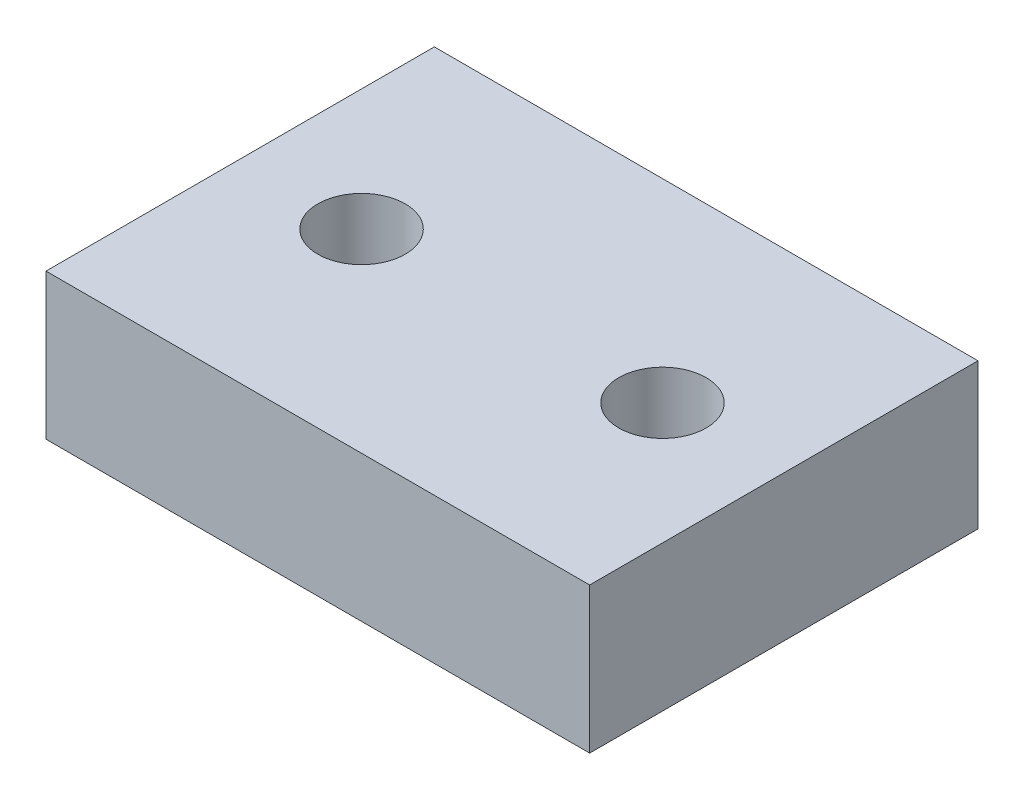
ISO-10303-21;
HEADER;
FILE_DESCRIPTION(('STEP AP214'),'2;1');
FILE_NAME('part.step','',(''),(''),'','','');
FILE_SCHEMA(('AUTOMOTIVE_DESIGN { 1 0 10303 214 1 1 1 1 }'));
ENDSEC;
DATA;
#1=APPLICATION_CONTEXT('core data for automotive mechanical design processes');
#2=APPLICATION_PROTOCOL_DEFINITION('international standard','automotive_design',2000,#1);
#3=PRODUCT_CONTEXT('',#1,'mechanical');
#4=PRODUCT('Part','Part','',(#3));
#5=PRODUCT_RELATED_PRODUCT_CATEGORY('part','',(#4));
#6=PRODUCT_DEFINITION_FORMATION('','',#4);
#7=PRODUCT_DEFINITION_CONTEXT('part definition',#1,'design');
#8=PRODUCT_DEFINITION('design','',#6,#7);
#9=PRODUCT_DEFINITION_SHAPE('','',#8);
#10=(LENGTH_UNIT() NAMED_UNIT(*) SI_UNIT(.MILLI.,.METRE.));
#11=(NAMED_UNIT(*) PLANE_ANGLE_UNIT() SI_UNIT($,.RADIAN.));
#12=(NAMED_UNIT(*) SI_UNIT($,.STERADIAN.) SOLID_ANGLE_UNIT());
#13=UNCERTAINTY_MEASURE_WITH_UNIT(LENGTH_MEASURE(1.E-05),#10,'distance_accuracy_value','');
#14=(GEOMETRIC_REPRESENTATION_CONTEXT(3) GLOBAL_UNCERTAINTY_ASSIGNED_CONTEXT((#13)) GLOBAL_UNIT_ASSIGNED_CONTEXT((#10,
#11,#12)) REPRESENTATION_CONTEXT('',''));
#15=CARTESIAN_POINT('',(0.,0.,0.));
#16=DIRECTION('',(0.,0.,1.));
#17=DIRECTION('',(1.,0.,0.));
#18=AXIS2_PLACEMENT_3D('',#15,#16,#17);
#19=CARTESIAN_POINT('',(0.,3.75,0.));
#20=DIRECTION('',(0.,1.,0.));
#21=DIRECTION('',(0.,0.,1.));
#22=AXIS2_PLACEMENT_3D('',#19,#20,#21);
#23=PLANE('',#22);
#24=CARTESIAN_POINT('',(-7.75,3.75,0.));
#25=DIRECTION('',(0.,1.,0.));
#26=DIRECTION('',(0.,0.,1.));
#27=AXIS2_PLACEMENT_3D('',#24,#25,#26);
#28=CIRCLE('',#27,2.25);
#29=CARTESIAN_POINT('',(-7.75,3.75,2.25));
#30=VERTEX_POINT('',#29);
#31=EDGE_CURVE('E118',#30,#30,#28,.T.);
#32=ORIENTED_EDGE('',*,*,#31,.F.);
#33=EDGE_LOOP('',(#32));
#34=FACE_BOUND('',#33,.T.);
#35=DIRECTION('',(0.,0.,1.));
#36=VECTOR('',#35,1.);
#37=CARTESIAN_POINT('',(-14.,3.75,10.));
#38=LINE('',#37,#36);
#39=CARTESIAN_POINT('',(-14.,3.75,-10.));
#40=VERTEX_POINT('',#39);
#41=CARTESIAN_POINT('',(-14.,3.75,10.));
#42=VERTEX_POINT('',#41);
#43=EDGE_CURVE('E98',#40,#42,#38,.T.);
#44=ORIENTED_EDGE('',*,*,#43,.T.);
#45=DIRECTION('',(1.,0.,0.));
#46=VECTOR('',#45,1.);
#47=CARTESIAN_POINT('',(14.,3.75,10.));
#48=LINE('',#47,#46);
#49=CARTESIAN_POINT('',(14.,3.75,10.));
#50=VERTEX_POINT('',#49);
#51=EDGE_CURVE('E93',#42,#50,#48,.T.);
#52=ORIENTED_EDGE('',*,*,#51,.T.);
#53=DIRECTION('',(0.,0.,-1.));
#54=VECTOR('',#53,1.);
#55=CARTESIAN_POINT('',(14.,3.75,10.));
#56=LINE('',#55,#54);
#57=CARTESIAN_POINT('',(14.,3.75,-10.));
#58=VERTEX_POINT('',#57);
#59=EDGE_CURVE('E96',#50,#58,#56,.T.);
#60=ORIENTED_EDGE('',*,*,#59,.T.);
#61=DIRECTION('',(-1.,0.,0.));
#62=VECTOR('',#61,1.);
#63=CARTESIAN_POINT('',(14.,3.75,-10.));
#64=LINE('',#63,#62);
#65=EDGE_CURVE('E63',#58,#40,#64,.T.);
#66=ORIENTED_EDGE('',*,*,#65,.T.);
#67=EDGE_LOOP('',(#44,#52,#60,#66));
#68=FACE_BOUND('',#67,.T.);
#69=CARTESIAN_POINT('',(7.75,3.75,0.));
#70=DIRECTION('',(0.,1.,0.));
#71=DIRECTION('',(0.,0.,1.));
#72=AXIS2_PLACEMENT_3D('',#69,#70,#71);
#73=CIRCLE('',#72,2.25);
#74=CARTESIAN_POINT('',(7.75,3.75,2.25));
#75=VERTEX_POINT('',#74);
#76=EDGE_CURVE('E140',#75,#75,#73,.T.);
#77=ORIENTED_EDGE('',*,*,#76,.F.);
#78=EDGE_LOOP('',(#77));
#79=FACE_BOUND('',#78,.T.);
#80=ADVANCED_FACE('F45',(#34,#68,#79),#23,.T.);
#81=CARTESIAN_POINT('',(0.,-3.75,0.));
#82=DIRECTION('',(0.,1.,0.));
#83=DIRECTION('',(0.,0.,1.));
#84=AXIS2_PLACEMENT_3D('',#81,#82,#83);
#85=PLANE('',#84);
#86=DIRECTION('',(0.,0.,1.));
#87=VECTOR('',#86,1.);
#88=CARTESIAN_POINT('',(-14.,-3.75,10.));
#89=LINE('',#88,#87);
#90=CARTESIAN_POINT('',(-14.,-3.75,-10.));
#91=VERTEX_POINT('',#90);
#92=CARTESIAN_POINT('',(-14.,-3.75,10.));
#93=VERTEX_POINT('',#92);
#94=EDGE_CURVE('E114',#91,#93,#89,.T.);
#95=ORIENTED_EDGE('',*,*,#94,.F.);
#96=DIRECTION('',(-1.,0.,0.));
#97=VECTOR('',#96,1.);
#98=CARTESIAN_POINT('',(14.,-3.75,-10.));
#99=LINE('',#98,#97);
#100=CARTESIAN_POINT('',(14.,-3.75,-10.));
#101=VERTEX_POINT('',#100);
#102=EDGE_CURVE('E86',#101,#91,#99,.T.);
#103=ORIENTED_EDGE('',*,*,#102,.F.);
#104=DIRECTION('',(0.,0.,-1.));
#105=VECTOR('',#104,1.);
#106=CARTESIAN_POINT('',(14.,-3.75,10.));
#107=LINE('',#106,#105);
#108=CARTESIAN_POINT('',(14.,-3.75,10.));
#109=VERTEX_POINT('',#108);
#110=EDGE_CURVE('E80',#109,#101,#107,.T.);
#111=ORIENTED_EDGE('',*,*,#110,.F.);
#112=DIRECTION('',(1.,0.,0.));
#113=VECTOR('',#112,1.);
#114=CARTESIAN_POINT('',(14.,-3.75,10.));
#115=LINE('',#114,#113);
#116=EDGE_CURVE('E103',#93,#109,#115,.T.);
#117=ORIENTED_EDGE('',*,*,#116,.F.);
#118=EDGE_LOOP('',(#95,#103,#111,#117));
#119=FACE_BOUND('',#118,.T.);
#120=CARTESIAN_POINT('',(-7.75,-3.75,0.));
#121=DIRECTION('',(0.,1.,0.));
#122=DIRECTION('',(0.,0.,1.));
#123=AXIS2_PLACEMENT_3D('',#120,#121,#122);
#124=CIRCLE('',#123,2.25);
#125=CARTESIAN_POINT('',(-7.75,-3.75,2.25));
#126=VERTEX_POINT('',#125);
#127=EDGE_CURVE('E136',#126,#126,#124,.T.);
#128=ORIENTED_EDGE('',*,*,#127,.T.);
#129=EDGE_LOOP('',(#128));
#130=FACE_BOUND('',#129,.T.);
#131=CARTESIAN_POINT('',(7.75,-3.75,0.));
#132=DIRECTION('',(0.,1.,0.));
#133=DIRECTION('',(0.,0.,1.));
#134=AXIS2_PLACEMENT_3D('',#131,#132,#133);
#135=CIRCLE('',#134,2.25);
#136=CARTESIAN_POINT('',(7.75,-3.75,2.25));
#137=VERTEX_POINT('',#136);
#138=EDGE_CURVE('E144',#137,#137,#135,.T.);
#139=ORIENTED_EDGE('',*,*,#138,.T.);
#140=EDGE_LOOP('',(#139));
#141=FACE_BOUND('',#140,.T.);
#142=ADVANCED_FACE('F131',(#119,#130,#141),#85,.F.);
#143=CARTESIAN_POINT('',(-14.,3.75,10.));
#144=DIRECTION('',(1.,0.,0.));
#145=DIRECTION('',(0.,0.,-1.));
#146=AXIS2_PLACEMENT_3D('',#143,#144,#145);
#147=PLANE('',#146);
#148=ORIENTED_EDGE('',*,*,#94,.T.);
#149=DIRECTION('',(0.,-1.,0.));
#150=VECTOR('',#149,1.);
#151=CARTESIAN_POINT('',(-14.,3.75,10.));
#152=LINE('',#151,#150);
#153=EDGE_CURVE('E11',#42,#93,#152,.T.);
#154=ORIENTED_EDGE('',*,*,#153,.F.);
#155=ORIENTED_EDGE('',*,*,#43,.F.);
#156=DIRECTION('',(0.,-1.,0.));
#157=VECTOR('',#156,1.);
#158=CARTESIAN_POINT('',(-14.,3.75,-10.));
#159=LINE('',#158,#157);
#160=EDGE_CURVE('E110',#40,#91,#159,.T.);
#161=ORIENTED_EDGE('',*,*,#160,.T.);
#162=EDGE_LOOP('',(#148,#154,#155,#161));
#163=FACE_BOUND('',#162,.T.);
#164=ADVANCED_FACE('F47',(#163),#147,.F.);
#165=CARTESIAN_POINT('',(14.,3.75,10.));
#166=DIRECTION('',(0.,0.,-1.));
#167=DIRECTION('',(-1.,0.,0.));
#168=AXIS2_PLACEMENT_3D('',#165,#166,#167);
#169=PLANE('',#168);
#170=ORIENTED_EDGE('',*,*,#116,.T.);
#171=DIRECTION('',(0.,-1.,0.));
#172=VECTOR('',#171,1.);
#173=CARTESIAN_POINT('',(14.,3.75,10.));
#174=LINE('',#173,#172);
#175=EDGE_CURVE('E55',#50,#109,#174,.T.);
#176=ORIENTED_EDGE('',*,*,#175,.F.);
#177=ORIENTED_EDGE('',*,*,#51,.F.);
#178=ORIENTED_EDGE('',*,*,#153,.T.);
#179=EDGE_LOOP('',(#170,#176,#177,#178));
#180=FACE_BOUND('',#179,.T.);
#181=ADVANCED_FACE('F102',(#180),#169,.F.);
#182=CARTESIAN_POINT('',(14.,3.75,10.));
#183=DIRECTION('',(-1.,0.,0.));
#184=DIRECTION('',(0.,0.,1.));
#185=AXIS2_PLACEMENT_3D('',#182,#183,#184);
#186=PLANE('',#185);
#187=ORIENTED_EDGE('',*,*,#110,.T.);
#188=DIRECTION('',(0.,-1.,0.));
#189=VECTOR('',#188,1.);
#190=CARTESIAN_POINT('',(14.,3.75,-10.));
#191=LINE('',#190,#189);
#192=EDGE_CURVE('E105',#58,#101,#191,.T.);
#193=ORIENTED_EDGE('',*,*,#192,.F.);
#194=ORIENTED_EDGE('',*,*,#59,.F.);
#195=ORIENTED_EDGE('',*,*,#175,.T.);
#196=EDGE_LOOP('',(#187,#193,#194,#195));
#197=FACE_BOUND('',#196,.T.);
#198=ADVANCED_FACE('F106',(#197),#186,.F.);
#199=CARTESIAN_POINT('',(14.,3.75,-10.));
#200=DIRECTION('',(0.,0.,1.));
#201=DIRECTION('',(1.,0.,0.));
#202=AXIS2_PLACEMENT_3D('',#199,#200,#201);
#203=PLANE('',#202);
#204=ORIENTED_EDGE('',*,*,#102,.T.);
#205=ORIENTED_EDGE('',*,*,#160,.F.);
#206=ORIENTED_EDGE('',*,*,#65,.F.);
#207=ORIENTED_EDGE('',*,*,#192,.T.);
#208=EDGE_LOOP('',(#204,#205,#206,#207));
#209=FACE_BOUND('',#208,.T.);
#210=ADVANCED_FACE('F128',(#209),#203,.F.);
#211=CARTESIAN_POINT('',(-7.75,3.75,0.));
#212=DIRECTION('',(0.,-1.,0.));
#213=DIRECTION('',(0.,0.,-1.));
#214=AXIS2_PLACEMENT_3D('',#211,#212,#213);
#215=CYLINDRICAL_SURFACE('',#214,2.25);
#216=ORIENTED_EDGE('',*,*,#31,.T.);
#217=EDGE_LOOP('',(#216));
#218=FACE_BOUND('',#217,.T.);
#219=ORIENTED_EDGE('',*,*,#127,.F.);
#220=EDGE_LOOP('',(#219));
#221=FACE_BOUND('',#220,.T.);
#222=ADVANCED_FACE('F163',(#218,#221),#215,.F.);
#223=CARTESIAN_POINT('',(7.75,3.75,0.));
#224=DIRECTION('',(0.,-1.,0.));
#225=DIRECTION('',(0.,0.,-1.));
#226=AXIS2_PLACEMENT_3D('',#223,#224,#225);
#227=CYLINDRICAL_SURFACE('',#226,2.25);
#228=ORIENTED_EDGE('',*,*,#76,.T.);
#229=EDGE_LOOP('',(#228));
#230=FACE_BOUND('',#229,.T.);
#231=ORIENTED_EDGE('',*,*,#138,.F.);
#232=EDGE_LOOP('',(#231));
#233=FACE_BOUND('',#232,.T.);
#234=ADVANCED_FACE('F152',(#230,#233),#227,.F.);
#235=CLOSED_SHELL('',(#80,#142,#164,#181,#198,#210,#222,#234));
#236=MANIFOLD_SOLID_BREP('B2',#235);
#237=ADVANCED_BREP_SHAPE_REPRESENTATION('',(#18,#236),#14);
#238=SHAPE_DEFINITION_REPRESENTATION(#9,#237);
ENDSEC;
END-ISO-10303-21;
